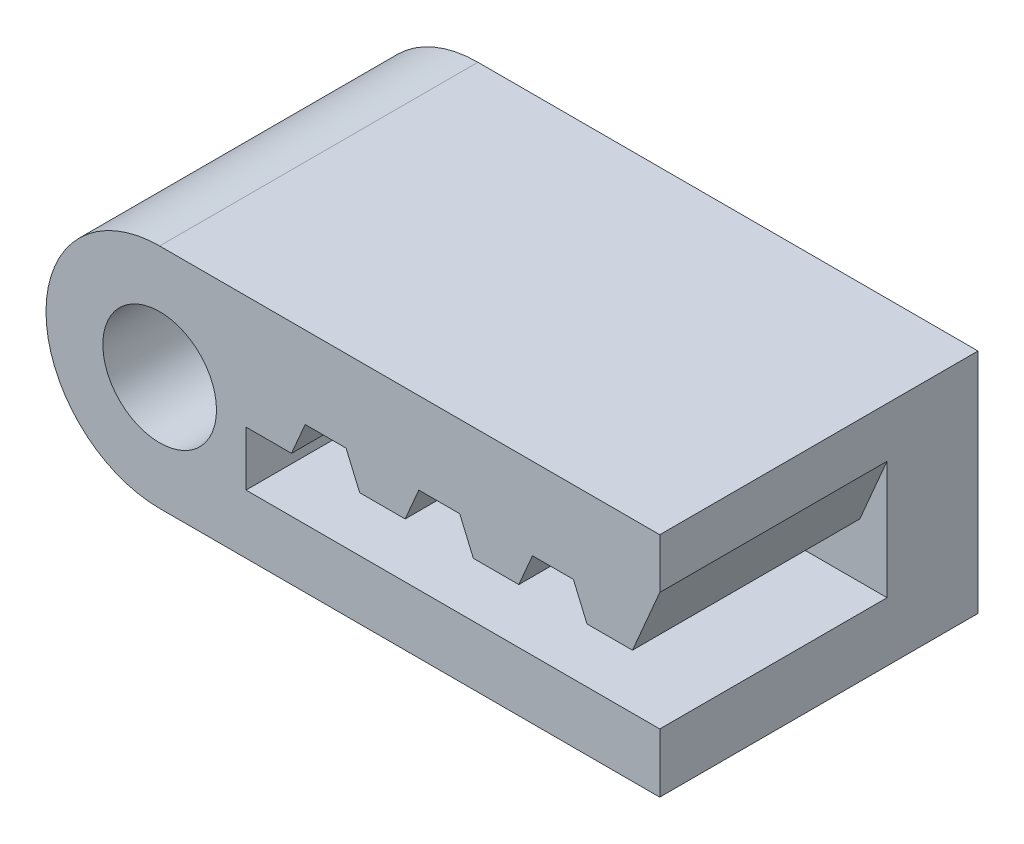
ISO-10303-21;
HEADER;
FILE_DESCRIPTION(('STEP AP214'),'2;1');
FILE_NAME('part.step','',(''),(''),'','','');
FILE_SCHEMA(('AUTOMOTIVE_DESIGN { 1 0 10303 214 1 1 1 1 }'));
ENDSEC;
DATA;
#1=APPLICATION_CONTEXT('core data for automotive mechanical design processes');
#2=APPLICATION_PROTOCOL_DEFINITION('international standard','automotive_design',2000,#1);
#3=PRODUCT_CONTEXT('',#1,'mechanical');
#4=PRODUCT('Part','Part','',(#3));
#5=PRODUCT_RELATED_PRODUCT_CATEGORY('part','',(#4));
#6=PRODUCT_DEFINITION_FORMATION('','',#4);
#7=PRODUCT_DEFINITION_CONTEXT('part definition',#1,'design');
#8=PRODUCT_DEFINITION('design','',#6,#7);
#9=PRODUCT_DEFINITION_SHAPE('','',#8);
#10=(LENGTH_UNIT() NAMED_UNIT(*) SI_UNIT(.MILLI.,.METRE.));
#11=(NAMED_UNIT(*) PLANE_ANGLE_UNIT() SI_UNIT($,.RADIAN.));
#12=(NAMED_UNIT(*) SI_UNIT($,.STERADIAN.) SOLID_ANGLE_UNIT());
#13=UNCERTAINTY_MEASURE_WITH_UNIT(LENGTH_MEASURE(1.E-05),#10,'distance_accuracy_value','');
#14=(GEOMETRIC_REPRESENTATION_CONTEXT(3) GLOBAL_UNCERTAINTY_ASSIGNED_CONTEXT((#13)) GLOBAL_UNIT_ASSIGNED_CONTEXT((#10,
#11,#12)) REPRESENTATION_CONTEXT('',''));
#15=CARTESIAN_POINT('',(0.,0.,0.));
#16=DIRECTION('',(0.,0.,1.));
#17=DIRECTION('',(1.,0.,0.));
#18=AXIS2_PLACEMENT_3D('',#15,#16,#17);
#19=CARTESIAN_POINT('',(0.,2.5,7.));
#20=DIRECTION('',(0.,0.,-1.));
#21=DIRECTION('',(-1.,0.,0.));
#22=AXIS2_PLACEMENT_3D('',#19,#20,#21);
#23=CYLINDRICAL_SURFACE('',#22,2.5);
#24=CARTESIAN_POINT('',(0.,2.5,0.));
#25=DIRECTION('',(0.,0.,1.));
#26=DIRECTION('',(1.,0.,0.));
#27=AXIS2_PLACEMENT_3D('',#24,#25,#26);
#28=CIRCLE('',#27,2.5);
#29=CARTESIAN_POINT('',(0.,5.,0.));
#30=VERTEX_POINT('',#29);
#31=CARTESIAN_POINT('',(0.,0.,0.));
#32=VERTEX_POINT('',#31);
#33=EDGE_CURVE('E280',#30,#32,#28,.T.);
#34=ORIENTED_EDGE('',*,*,#33,.T.);
#35=DIRECTION('',(0.,0.,-1.));
#36=VECTOR('',#35,1.);
#37=CARTESIAN_POINT('',(0.,0.,7.));
#38=LINE('',#37,#36);
#39=CARTESIAN_POINT('',(0.,0.,7.));
#40=VERTEX_POINT('',#39);
#41=EDGE_CURVE('E12',#40,#32,#38,.T.);
#42=ORIENTED_EDGE('',*,*,#41,.F.);
#43=CARTESIAN_POINT('',(0.,2.5,7.));
#44=DIRECTION('',(0.,0.,1.));
#45=DIRECTION('',(1.,0.,0.));
#46=AXIS2_PLACEMENT_3D('',#43,#44,#45);
#47=CIRCLE('',#46,2.5);
#48=CARTESIAN_POINT('',(0.,5.,7.));
#49=VERTEX_POINT('',#48);
#50=EDGE_CURVE('E282',#49,#40,#47,.T.);
#51=ORIENTED_EDGE('',*,*,#50,.F.);
#52=DIRECTION('',(0.,0.,-1.));
#53=VECTOR('',#52,1.);
#54=CARTESIAN_POINT('',(0.,5.,7.));
#55=LINE('',#54,#53);
#56=EDGE_CURVE('E290',#49,#30,#55,.T.);
#57=ORIENTED_EDGE('',*,*,#56,.T.);
#58=EDGE_LOOP('',(#34,#42,#51,#57));
#59=FACE_BOUND('',#58,.T.);
#60=ADVANCED_FACE('F32',(#59),#23,.T.);
#61=CARTESIAN_POINT('',(0.,0.,7.));
#62=DIRECTION('',(0.,1.,0.));
#63=DIRECTION('',(0.,0.,1.));
#64=AXIS2_PLACEMENT_3D('',#61,#62,#63);
#65=PLANE('',#64);
#66=DIRECTION('',(1.,0.,0.));
#67=VECTOR('',#66,1.);
#68=CARTESIAN_POINT('',(0.,0.,0.));
#69=LINE('',#68,#67);
#70=CARTESIAN_POINT('',(11.,0.,0.));
#71=VERTEX_POINT('',#70);
#72=EDGE_CURVE('E293',#32,#71,#69,.T.);
#73=ORIENTED_EDGE('',*,*,#72,.T.);
#74=DIRECTION('',(0.,0.,-1.));
#75=VECTOR('',#74,1.);
#76=CARTESIAN_POINT('',(11.,0.,7.));
#77=LINE('',#76,#75);
#78=CARTESIAN_POINT('',(11.,0.,7.));
#79=VERTEX_POINT('',#78);
#80=EDGE_CURVE('E39',#79,#71,#77,.T.);
#81=ORIENTED_EDGE('',*,*,#80,.F.);
#82=DIRECTION('',(1.,0.,0.));
#83=VECTOR('',#82,1.);
#84=CARTESIAN_POINT('',(0.,0.,7.));
#85=LINE('',#84,#83);
#86=EDGE_CURVE('E83',#40,#79,#85,.T.);
#87=ORIENTED_EDGE('',*,*,#86,.F.);
#88=ORIENTED_EDGE('',*,*,#41,.T.);
#89=EDGE_LOOP('',(#73,#81,#87,#88));
#90=FACE_BOUND('',#89,.T.);
#91=ADVANCED_FACE('F372',(#90),#65,.F.);
#92=CARTESIAN_POINT('',(11.,0.,7.));
#93=DIRECTION('',(-1.,0.,0.));
#94=DIRECTION('',(0.,0.,1.));
#95=AXIS2_PLACEMENT_3D('',#92,#93,#94);
#96=PLANE('',#95);
#97=DIRECTION('',(0.,-1.,0.));
#98=VECTOR('',#97,1.);
#99=CARTESIAN_POINT('',(11.,1.3,2.));
#100=LINE('',#99,#98);
#101=CARTESIAN_POINT('',(11.,3.9,2.));
#102=VERTEX_POINT('',#101);
#103=CARTESIAN_POINT('',(11.,1.3,2.));
#104=VERTEX_POINT('',#103);
#105=EDGE_CURVE('E281',#102,#104,#100,.T.);
#106=ORIENTED_EDGE('',*,*,#105,.T.);
#107=DIRECTION('',(0.,0.,1.));
#108=VECTOR('',#107,1.);
#109=CARTESIAN_POINT('',(11.,1.3,-9.46414285606468));
#110=LINE('',#109,#108);
#111=CARTESIAN_POINT('',(11.,1.3,7.));
#112=VERTEX_POINT('',#111);
#113=EDGE_CURVE('E247',#104,#112,#110,.T.);
#114=ORIENTED_EDGE('',*,*,#113,.T.);
#115=DIRECTION('',(0.,1.,0.));
#116=VECTOR('',#115,1.);
#117=CARTESIAN_POINT('',(11.,0.,7.));
#118=LINE('',#117,#116);
#119=EDGE_CURVE('E286',#79,#112,#118,.T.);
#120=ORIENTED_EDGE('',*,*,#119,.F.);
#121=ORIENTED_EDGE('',*,*,#80,.T.);
#122=DIRECTION('',(0.,1.,0.));
#123=VECTOR('',#122,1.);
#124=CARTESIAN_POINT('',(11.,0.,0.));
#125=LINE('',#124,#123);
#126=CARTESIAN_POINT('',(11.,5.,0.));
#127=VERTEX_POINT('',#126);
#128=EDGE_CURVE('E295',#71,#127,#125,.T.);
#129=ORIENTED_EDGE('',*,*,#128,.T.);
#130=DIRECTION('',(0.,0.,-1.));
#131=VECTOR('',#130,1.);
#132=CARTESIAN_POINT('',(11.,5.,7.));
#133=LINE('',#132,#131);
#134=CARTESIAN_POINT('',(11.,5.,7.));
#135=VERTEX_POINT('',#134);
#136=EDGE_CURVE('E299',#135,#127,#133,.T.);
#137=ORIENTED_EDGE('',*,*,#136,.F.);
#138=CARTESIAN_POINT('',(11.,3.90000000000001,7.));
#139=VERTEX_POINT('',#138);
#140=EDGE_CURVE('E285',#139,#135,#118,.T.);
#141=ORIENTED_EDGE('',*,*,#140,.F.);
#142=DIRECTION('',(0.,0.,1.));
#143=VECTOR('',#142,1.);
#144=CARTESIAN_POINT('',(11.,3.9,-9.46414285606468));
#145=LINE('',#144,#143);
#146=EDGE_CURVE('E46',#102,#139,#145,.T.);
#147=ORIENTED_EDGE('',*,*,#146,.F.);
#148=EDGE_LOOP('',(#106,#114,#120,#121,#129,#137,#141,#147));
#149=FACE_BOUND('',#148,.T.);
#150=ADVANCED_FACE('F305',(#149),#96,.F.);
#151=CARTESIAN_POINT('',(0.,5.,7.));
#152=DIRECTION('',(0.,-1.,0.));
#153=DIRECTION('',(0.,0.,-1.));
#154=AXIS2_PLACEMENT_3D('',#151,#152,#153);
#155=PLANE('',#154);
#156=DIRECTION('',(-1.,0.,0.));
#157=VECTOR('',#156,1.);
#158=CARTESIAN_POINT('',(0.,5.,0.));
#159=LINE('',#158,#157);
#160=EDGE_CURVE('E76',#127,#30,#159,.T.);
#161=ORIENTED_EDGE('',*,*,#160,.T.);
#162=ORIENTED_EDGE('',*,*,#56,.F.);
#163=DIRECTION('',(-1.,0.,0.));
#164=VECTOR('',#163,1.);
#165=CARTESIAN_POINT('',(0.,5.,7.));
#166=LINE('',#165,#164);
#167=EDGE_CURVE('E55',#135,#49,#166,.T.);
#168=ORIENTED_EDGE('',*,*,#167,.F.);
#169=ORIENTED_EDGE('',*,*,#136,.T.);
#170=EDGE_LOOP('',(#161,#162,#168,#169));
#171=FACE_BOUND('',#170,.T.);
#172=ADVANCED_FACE('F313',(#171),#155,.F.);
#173=CARTESIAN_POINT('',(0.,2.5,7.));
#174=DIRECTION('',(0.,0.,1.));
#175=DIRECTION('',(1.,0.,0.));
#176=AXIS2_PLACEMENT_3D('',#173,#174,#175);
#177=PLANE('',#176);
#178=CARTESIAN_POINT('',(0.,2.5,7.));
#179=DIRECTION('',(0.,0.,1.));
#180=DIRECTION('',(1.,0.,0.));
#181=AXIS2_PLACEMENT_3D('',#178,#179,#180);
#182=CIRCLE('',#181,1.25);
#183=CARTESIAN_POINT('',(1.25,2.5,7.));
#184=VERTEX_POINT('',#183);
#185=EDGE_CURVE('E347',#184,#184,#182,.T.);
#186=ORIENTED_EDGE('',*,*,#185,.F.);
#187=EDGE_LOOP('',(#186));
#188=FACE_BOUND('',#187,.T.);
#189=DIRECTION('',(1.,0.,0.));
#190=VECTOR('',#189,1.);
#191=CARTESIAN_POINT('',(1.89999999999999,1.3,7.));
#192=LINE('',#191,#190);
#193=CARTESIAN_POINT('',(1.89999999999999,1.3,7.));
#194=VERTEX_POINT('',#193);
#195=EDGE_CURVE('E245',#194,#112,#192,.T.);
#196=ORIENTED_EDGE('',*,*,#195,.F.);
#197=DIRECTION('',(0.,-1.,0.));
#198=VECTOR('',#197,1.);
#199=CARTESIAN_POINT('',(1.89999999999999,2.5,7.));
#200=LINE('',#199,#198);
#201=CARTESIAN_POINT('',(1.89999999999999,2.5,7.));
#202=VERTEX_POINT('',#201);
#203=EDGE_CURVE('E242',#202,#194,#200,.T.);
#204=ORIENTED_EDGE('',*,*,#203,.F.);
#205=DIRECTION('',(-1.,0.,0.));
#206=VECTOR('',#205,1.);
#207=CARTESIAN_POINT('',(2.89999999999999,2.5,7.));
#208=LINE('',#207,#206);
#209=CARTESIAN_POINT('',(2.89999999999999,2.5,7.));
#210=VERTEX_POINT('',#209);
#211=EDGE_CURVE('E239',#210,#202,#208,.T.);
#212=ORIENTED_EDGE('',*,*,#211,.F.);
#213=DIRECTION('',(-0.39391929857917,-0.919145030018057,0.));
#214=VECTOR('',#213,1.);
#215=CARTESIAN_POINT('',(3.2,3.2,7.));
#216=LINE('',#215,#214);
#217=CARTESIAN_POINT('',(3.2,3.2,7.));
#218=VERTEX_POINT('',#217);
#219=EDGE_CURVE('E236',#218,#210,#216,.T.);
#220=ORIENTED_EDGE('',*,*,#219,.F.);
#221=DIRECTION('',(-1.,0.,0.));
#222=VECTOR('',#221,1.);
#223=CARTESIAN_POINT('',(4.1,3.2,7.));
#224=LINE('',#223,#222);
#225=CARTESIAN_POINT('',(4.1,3.2,7.));
#226=VERTEX_POINT('',#225);
#227=EDGE_CURVE('E233',#226,#218,#224,.T.);
#228=ORIENTED_EDGE('',*,*,#227,.F.);
#229=DIRECTION('',(-0.393919298579169,0.919145030018057,0.));
#230=VECTOR('',#229,1.);
#231=CARTESIAN_POINT('',(4.4,2.5,7.));
#232=LINE('',#231,#230);
#233=CARTESIAN_POINT('',(4.4,2.5,7.));
#234=VERTEX_POINT('',#233);
#235=EDGE_CURVE('E230',#234,#226,#232,.T.);
#236=ORIENTED_EDGE('',*,*,#235,.F.);
#237=DIRECTION('',(-1.,0.,0.));
#238=VECTOR('',#237,1.);
#239=CARTESIAN_POINT('',(5.4,2.5,7.));
#240=LINE('',#239,#238);
#241=CARTESIAN_POINT('',(5.4,2.5,7.));
#242=VERTEX_POINT('',#241);
#243=EDGE_CURVE('E227',#242,#234,#240,.T.);
#244=ORIENTED_EDGE('',*,*,#243,.F.);
#245=DIRECTION('',(-0.39391929857917,-0.919145030018057,0.));
#246=VECTOR('',#245,1.);
#247=CARTESIAN_POINT('',(5.7,3.2,7.));
#248=LINE('',#247,#246);
#249=CARTESIAN_POINT('',(5.7,3.2,7.));
#250=VERTEX_POINT('',#249);
#251=EDGE_CURVE('E224',#250,#242,#248,.T.);
#252=ORIENTED_EDGE('',*,*,#251,.F.);
#253=DIRECTION('',(-1.,0.,0.));
#254=VECTOR('',#253,1.);
#255=CARTESIAN_POINT('',(6.6,3.2,7.));
#256=LINE('',#255,#254);
#257=CARTESIAN_POINT('',(6.6,3.2,7.));
#258=VERTEX_POINT('',#257);
#259=EDGE_CURVE('E221',#258,#250,#256,.T.);
#260=ORIENTED_EDGE('',*,*,#259,.F.);
#261=DIRECTION('',(-0.393919298579168,0.919145030018058,0.));
#262=VECTOR('',#261,1.);
#263=CARTESIAN_POINT('',(6.9,2.5,7.));
#264=LINE('',#263,#262);
#265=CARTESIAN_POINT('',(6.9,2.5,7.));
#266=VERTEX_POINT('',#265);
#267=EDGE_CURVE('E218',#266,#258,#264,.T.);
#268=ORIENTED_EDGE('',*,*,#267,.F.);
#269=DIRECTION('',(-1.,0.,0.));
#270=VECTOR('',#269,1.);
#271=CARTESIAN_POINT('',(7.9,2.5,7.));
#272=LINE('',#271,#270);
#273=CARTESIAN_POINT('',(7.9,2.5,7.));
#274=VERTEX_POINT('',#273);
#275=EDGE_CURVE('E215',#274,#266,#272,.T.);
#276=ORIENTED_EDGE('',*,*,#275,.F.);
#277=DIRECTION('',(-0.393919298579166,-0.919145030018059,0.));
#278=VECTOR('',#277,1.);
#279=CARTESIAN_POINT('',(8.2,3.2,7.));
#280=LINE('',#279,#278);
#281=CARTESIAN_POINT('',(8.2,3.2,7.));
#282=VERTEX_POINT('',#281);
#283=EDGE_CURVE('E212',#282,#274,#280,.T.);
#284=ORIENTED_EDGE('',*,*,#283,.F.);
#285=DIRECTION('',(-1.,0.,0.));
#286=VECTOR('',#285,1.);
#287=CARTESIAN_POINT('',(9.1,3.2,7.));
#288=LINE('',#287,#286);
#289=CARTESIAN_POINT('',(9.1,3.2,7.));
#290=VERTEX_POINT('',#289);
#291=EDGE_CURVE('E206',#290,#282,#288,.T.);
#292=ORIENTED_EDGE('',*,*,#291,.F.);
#293=DIRECTION('',(-0.393919298579167,0.919145030018058,0.));
#294=VECTOR('',#293,1.);
#295=CARTESIAN_POINT('',(9.4,2.5,7.));
#296=LINE('',#295,#294);
#297=CARTESIAN_POINT('',(9.4,2.5,7.));
#298=VERTEX_POINT('',#297);
#299=EDGE_CURVE('E204',#298,#290,#296,.T.);
#300=ORIENTED_EDGE('',*,*,#299,.F.);
#301=DIRECTION('',(-1.,0.,0.));
#302=VECTOR('',#301,1.);
#303=CARTESIAN_POINT('',(10.4,2.5,7.));
#304=LINE('',#303,#302);
#305=CARTESIAN_POINT('',(10.4,2.5,7.));
#306=VERTEX_POINT('',#305);
#307=EDGE_CURVE('E188',#306,#298,#304,.T.);
#308=ORIENTED_EDGE('',*,*,#307,.F.);
#309=DIRECTION('',(-0.393919298579167,-0.919145030018058,0.));
#310=VECTOR('',#309,1.);
#311=CARTESIAN_POINT('',(11.,3.9,7.));
#312=LINE('',#311,#310);
#313=EDGE_CURVE('E195',#139,#306,#312,.T.);
#314=ORIENTED_EDGE('',*,*,#313,.F.);
#315=ORIENTED_EDGE('',*,*,#140,.T.);
#316=ORIENTED_EDGE('',*,*,#167,.T.);
#317=ORIENTED_EDGE('',*,*,#50,.T.);
#318=ORIENTED_EDGE('',*,*,#86,.T.);
#319=ORIENTED_EDGE('',*,*,#119,.T.);
#320=EDGE_LOOP('',(#196,#204,#212,#220,#228,#236,#244,#252,#260,#268,#276,#284,#292,#300,#308,
#314,#315,#316,#317,#318,#319));
#321=FACE_BOUND('',#320,.T.);
#322=ADVANCED_FACE('F201',(#188,#321),#177,.T.);
#323=CARTESIAN_POINT('',(0.,2.5,0.));
#324=DIRECTION('',(0.,0.,1.));
#325=DIRECTION('',(1.,0.,0.));
#326=AXIS2_PLACEMENT_3D('',#323,#324,#325);
#327=PLANE('',#326);
#328=CARTESIAN_POINT('',(0.,2.5,0.));
#329=DIRECTION('',(0.,0.,1.));
#330=DIRECTION('',(1.,0.,0.));
#331=AXIS2_PLACEMENT_3D('',#328,#329,#330);
#332=CIRCLE('',#331,1.25);
#333=CARTESIAN_POINT('',(1.25,2.5,0.));
#334=VERTEX_POINT('',#333);
#335=EDGE_CURVE('E198',#334,#334,#332,.T.);
#336=ORIENTED_EDGE('',*,*,#335,.T.);
#337=EDGE_LOOP('',(#336));
#338=FACE_BOUND('',#337,.T.);
#339=ORIENTED_EDGE('',*,*,#33,.F.);
#340=ORIENTED_EDGE('',*,*,#160,.F.);
#341=ORIENTED_EDGE('',*,*,#128,.F.);
#342=ORIENTED_EDGE('',*,*,#72,.F.);
#343=EDGE_LOOP('',(#339,#340,#341,#342));
#344=FACE_BOUND('',#343,.T.);
#345=ADVANCED_FACE('F309',(#338,#344),#327,.F.);
#346=CARTESIAN_POINT('',(1.89999999999999,1.3,-9.46414285606468));
#347=DIRECTION('',(0.,-1.,0.));
#348=DIRECTION('',(0.,0.,-1.));
#349=AXIS2_PLACEMENT_3D('',#346,#347,#348);
#350=PLANE('',#349);
#351=DIRECTION('',(-1.,0.,0.));
#352=VECTOR('',#351,1.);
#353=CARTESIAN_POINT('',(1.89999999999999,1.3,2.));
#354=LINE('',#353,#352);
#355=CARTESIAN_POINT('',(1.89999999999999,1.3,2.));
#356=VERTEX_POINT('',#355);
#357=EDGE_CURVE('E317',#104,#356,#354,.T.);
#358=ORIENTED_EDGE('',*,*,#357,.T.);
#359=DIRECTION('',(0.,0.,1.));
#360=VECTOR('',#359,1.);
#361=CARTESIAN_POINT('',(1.89999999999999,1.3,-9.46414285606468));
#362=LINE('',#361,#360);
#363=EDGE_CURVE('E250',#356,#194,#362,.T.);
#364=ORIENTED_EDGE('',*,*,#363,.T.);
#365=ORIENTED_EDGE('',*,*,#195,.T.);
#366=ORIENTED_EDGE('',*,*,#113,.F.);
#367=EDGE_LOOP('',(#358,#364,#365,#366));
#368=FACE_BOUND('',#367,.T.);
#369=ADVANCED_FACE('F367',(#368),#350,.F.);
#370=CARTESIAN_POINT('',(1.89999999999999,2.5,-9.46414285606468));
#371=DIRECTION('',(-1.,0.,0.));
#372=DIRECTION('',(0.,0.,1.));
#373=AXIS2_PLACEMENT_3D('',#370,#371,#372);
#374=PLANE('',#373);
#375=DIRECTION('',(0.,1.,0.));
#376=VECTOR('',#375,1.);
#377=CARTESIAN_POINT('',(1.89999999999999,2.5,2.));
#378=LINE('',#377,#376);
#379=CARTESIAN_POINT('',(1.89999999999999,2.5,2.));
#380=VERTEX_POINT('',#379);
#381=EDGE_CURVE('E318',#356,#380,#378,.T.);
#382=ORIENTED_EDGE('',*,*,#381,.T.);
#383=DIRECTION('',(0.,0.,1.));
#384=VECTOR('',#383,1.);
#385=CARTESIAN_POINT('',(1.89999999999999,2.5,-9.46414285606468));
#386=LINE('',#385,#384);
#387=EDGE_CURVE('E252',#380,#202,#386,.T.);
#388=ORIENTED_EDGE('',*,*,#387,.T.);
#389=ORIENTED_EDGE('',*,*,#203,.T.);
#390=ORIENTED_EDGE('',*,*,#363,.F.);
#391=EDGE_LOOP('',(#382,#388,#389,#390));
#392=FACE_BOUND('',#391,.T.);
#393=ADVANCED_FACE('F417',(#392),#374,.F.);
#394=CARTESIAN_POINT('',(2.89999999999999,2.5,-9.46414285606468));
#395=DIRECTION('',(0.,1.,0.));
#396=DIRECTION('',(-1.,0.,0.));
#397=AXIS2_PLACEMENT_3D('',#394,#395,#396);
#398=PLANE('',#397);
#399=DIRECTION('',(1.,0.,0.));
#400=VECTOR('',#399,1.);
#401=CARTESIAN_POINT('',(2.89999999999999,2.5,2.));
#402=LINE('',#401,#400);
#403=CARTESIAN_POINT('',(2.89999999999999,2.5,2.));
#404=VERTEX_POINT('',#403);
#405=EDGE_CURVE('E322',#380,#404,#402,.T.);
#406=ORIENTED_EDGE('',*,*,#405,.T.);
#407=DIRECTION('',(0.,0.,1.));
#408=VECTOR('',#407,1.);
#409=CARTESIAN_POINT('',(2.89999999999999,2.5,-9.46414285606468));
#410=LINE('',#409,#408);
#411=EDGE_CURVE('E254',#404,#210,#410,.T.);
#412=ORIENTED_EDGE('',*,*,#411,.T.);
#413=ORIENTED_EDGE('',*,*,#211,.T.);
#414=ORIENTED_EDGE('',*,*,#387,.F.);
#415=EDGE_LOOP('',(#406,#412,#413,#414));
#416=FACE_BOUND('',#415,.T.);
#417=ADVANCED_FACE('F426',(#416),#398,.F.);
#418=CARTESIAN_POINT('',(3.2,3.2,-9.46414285606468));
#419=DIRECTION('',(-0.919145030018057,0.39391929857917,0.));
#420=DIRECTION('',(-0.39391929857917,-0.919145030018057,0.));
#421=AXIS2_PLACEMENT_3D('',#418,#419,#420);
#422=PLANE('',#421);
#423=DIRECTION('',(0.39391929857917,0.919145030018057,0.));
#424=VECTOR('',#423,1.);
#425=CARTESIAN_POINT('',(3.2,3.2,2.));
#426=LINE('',#425,#424);
#427=CARTESIAN_POINT('',(3.2,3.2,2.));
#428=VERTEX_POINT('',#427);
#429=EDGE_CURVE('E324',#404,#428,#426,.T.);
#430=ORIENTED_EDGE('',*,*,#429,.T.);
#431=DIRECTION('',(0.,0.,1.));
#432=VECTOR('',#431,1.);
#433=CARTESIAN_POINT('',(3.2,3.2,-9.46414285606468));
#434=LINE('',#433,#432);
#435=EDGE_CURVE('E256',#428,#218,#434,.T.);
#436=ORIENTED_EDGE('',*,*,#435,.T.);
#437=ORIENTED_EDGE('',*,*,#219,.T.);
#438=ORIENTED_EDGE('',*,*,#411,.F.);
#439=EDGE_LOOP('',(#430,#436,#437,#438));
#440=FACE_BOUND('',#439,.T.);
#441=ADVANCED_FACE('F435',(#440),#422,.F.);
#442=CARTESIAN_POINT('',(4.1,3.2,-9.46414285606468));
#443=DIRECTION('',(0.,1.,0.));
#444=DIRECTION('',(0.,0.,1.));
#445=AXIS2_PLACEMENT_3D('',#442,#443,#444);
#446=PLANE('',#445);
#447=DIRECTION('',(1.,0.,0.));
#448=VECTOR('',#447,1.);
#449=CARTESIAN_POINT('',(4.1,3.2,2.));
#450=LINE('',#449,#448);
#451=CARTESIAN_POINT('',(4.1,3.2,2.));
#452=VERTEX_POINT('',#451);
#453=EDGE_CURVE('E326',#428,#452,#450,.T.);
#454=ORIENTED_EDGE('',*,*,#453,.T.);
#455=DIRECTION('',(0.,0.,1.));
#456=VECTOR('',#455,1.);
#457=CARTESIAN_POINT('',(4.1,3.2,-9.46414285606468));
#458=LINE('',#457,#456);
#459=EDGE_CURVE('E258',#452,#226,#458,.T.);
#460=ORIENTED_EDGE('',*,*,#459,.T.);
#461=ORIENTED_EDGE('',*,*,#227,.T.);
#462=ORIENTED_EDGE('',*,*,#435,.F.);
#463=EDGE_LOOP('',(#454,#460,#461,#462));
#464=FACE_BOUND('',#463,.T.);
#465=ADVANCED_FACE('F444',(#464),#446,.F.);
#466=CARTESIAN_POINT('',(4.4,2.5,-9.46414285606468));
#467=DIRECTION('',(0.919145030018057,0.393919298579169,0.));
#468=DIRECTION('',(-0.393919298579169,0.919145030018057,0.));
#469=AXIS2_PLACEMENT_3D('',#466,#467,#468);
#470=PLANE('',#469);
#471=DIRECTION('',(0.393919298579169,-0.919145030018057,0.));
#472=VECTOR('',#471,1.);
#473=CARTESIAN_POINT('',(4.4,2.5,2.));
#474=LINE('',#473,#472);
#475=CARTESIAN_POINT('',(4.4,2.5,2.));
#476=VERTEX_POINT('',#475);
#477=EDGE_CURVE('E328',#452,#476,#474,.T.);
#478=ORIENTED_EDGE('',*,*,#477,.T.);
#479=DIRECTION('',(0.,0.,1.));
#480=VECTOR('',#479,1.);
#481=CARTESIAN_POINT('',(4.4,2.5,-9.46414285606468));
#482=LINE('',#481,#480);
#483=EDGE_CURVE('E260',#476,#234,#482,.T.);
#484=ORIENTED_EDGE('',*,*,#483,.T.);
#485=ORIENTED_EDGE('',*,*,#235,.T.);
#486=ORIENTED_EDGE('',*,*,#459,.F.);
#487=EDGE_LOOP('',(#478,#484,#485,#486));
#488=FACE_BOUND('',#487,.T.);
#489=ADVANCED_FACE('F453',(#488),#470,.F.);
#490=CARTESIAN_POINT('',(5.4,2.5,-9.46414285606468));
#491=DIRECTION('',(0.,1.,0.));
#492=DIRECTION('',(0.,0.,1.));
#493=AXIS2_PLACEMENT_3D('',#490,#491,#492);
#494=PLANE('',#493);
#495=DIRECTION('',(1.,0.,0.));
#496=VECTOR('',#495,1.);
#497=CARTESIAN_POINT('',(5.4,2.5,2.));
#498=LINE('',#497,#496);
#499=CARTESIAN_POINT('',(5.4,2.5,2.));
#500=VERTEX_POINT('',#499);
#501=EDGE_CURVE('E330',#476,#500,#498,.T.);
#502=ORIENTED_EDGE('',*,*,#501,.T.);
#503=DIRECTION('',(0.,0.,1.));
#504=VECTOR('',#503,1.);
#505=CARTESIAN_POINT('',(5.4,2.5,-9.46414285606468));
#506=LINE('',#505,#504);
#507=EDGE_CURVE('E262',#500,#242,#506,.T.);
#508=ORIENTED_EDGE('',*,*,#507,.T.);
#509=ORIENTED_EDGE('',*,*,#243,.T.);
#510=ORIENTED_EDGE('',*,*,#483,.F.);
#511=EDGE_LOOP('',(#502,#508,#509,#510));
#512=FACE_BOUND('',#511,.T.);
#513=ADVANCED_FACE('F462',(#512),#494,.F.);
#514=CARTESIAN_POINT('',(5.7,3.2,-9.46414285606468));
#515=DIRECTION('',(-0.919145030018057,0.39391929857917,0.));
#516=DIRECTION('',(-0.39391929857917,-0.919145030018057,0.));
#517=AXIS2_PLACEMENT_3D('',#514,#515,#516);
#518=PLANE('',#517);
#519=DIRECTION('',(0.39391929857917,0.919145030018057,0.));
#520=VECTOR('',#519,1.);
#521=CARTESIAN_POINT('',(5.7,3.2,2.));
#522=LINE('',#521,#520);
#523=CARTESIAN_POINT('',(5.7,3.2,2.));
#524=VERTEX_POINT('',#523);
#525=EDGE_CURVE('E332',#500,#524,#522,.T.);
#526=ORIENTED_EDGE('',*,*,#525,.T.);
#527=DIRECTION('',(0.,0.,1.));
#528=VECTOR('',#527,1.);
#529=CARTESIAN_POINT('',(5.7,3.2,-9.46414285606468));
#530=LINE('',#529,#528);
#531=EDGE_CURVE('E264',#524,#250,#530,.T.);
#532=ORIENTED_EDGE('',*,*,#531,.T.);
#533=ORIENTED_EDGE('',*,*,#251,.T.);
#534=ORIENTED_EDGE('',*,*,#507,.F.);
#535=EDGE_LOOP('',(#526,#532,#533,#534));
#536=FACE_BOUND('',#535,.T.);
#537=ADVANCED_FACE('F471',(#536),#518,.F.);
#538=CARTESIAN_POINT('',(6.6,3.2,-9.46414285606468));
#539=DIRECTION('',(0.,1.,0.));
#540=DIRECTION('',(0.,0.,1.));
#541=AXIS2_PLACEMENT_3D('',#538,#539,#540);
#542=PLANE('',#541);
#543=DIRECTION('',(1.,0.,0.));
#544=VECTOR('',#543,1.);
#545=CARTESIAN_POINT('',(6.6,3.2,2.));
#546=LINE('',#545,#544);
#547=CARTESIAN_POINT('',(6.6,3.2,2.));
#548=VERTEX_POINT('',#547);
#549=EDGE_CURVE('E334',#524,#548,#546,.T.);
#550=ORIENTED_EDGE('',*,*,#549,.T.);
#551=DIRECTION('',(0.,0.,1.));
#552=VECTOR('',#551,1.);
#553=CARTESIAN_POINT('',(6.6,3.2,-9.46414285606468));
#554=LINE('',#553,#552);
#555=EDGE_CURVE('E266',#548,#258,#554,.T.);
#556=ORIENTED_EDGE('',*,*,#555,.T.);
#557=ORIENTED_EDGE('',*,*,#259,.T.);
#558=ORIENTED_EDGE('',*,*,#531,.F.);
#559=EDGE_LOOP('',(#550,#556,#557,#558));
#560=FACE_BOUND('',#559,.T.);
#561=ADVANCED_FACE('F480',(#560),#542,.F.);
#562=CARTESIAN_POINT('',(6.9,2.5,-9.46414285606468));
#563=DIRECTION('',(0.919145030018058,0.393919298579168,0.));
#564=DIRECTION('',(-0.393919298579168,0.919145030018058,0.));
#565=AXIS2_PLACEMENT_3D('',#562,#563,#564);
#566=PLANE('',#565);
#567=DIRECTION('',(0.393919298579168,-0.919145030018058,0.));
#568=VECTOR('',#567,1.);
#569=CARTESIAN_POINT('',(6.9,2.5,2.));
#570=LINE('',#569,#568);
#571=CARTESIAN_POINT('',(6.9,2.5,2.));
#572=VERTEX_POINT('',#571);
#573=EDGE_CURVE('E336',#548,#572,#570,.T.);
#574=ORIENTED_EDGE('',*,*,#573,.T.);
#575=DIRECTION('',(0.,0.,1.));
#576=VECTOR('',#575,1.);
#577=CARTESIAN_POINT('',(6.9,2.5,-9.46414285606468));
#578=LINE('',#577,#576);
#579=EDGE_CURVE('E268',#572,#266,#578,.T.);
#580=ORIENTED_EDGE('',*,*,#579,.T.);
#581=ORIENTED_EDGE('',*,*,#267,.T.);
#582=ORIENTED_EDGE('',*,*,#555,.F.);
#583=EDGE_LOOP('',(#574,#580,#581,#582));
#584=FACE_BOUND('',#583,.T.);
#585=ADVANCED_FACE('F489',(#584),#566,.F.);
#586=CARTESIAN_POINT('',(7.9,2.5,-9.46414285606468));
#587=DIRECTION('',(0.,1.,0.));
#588=DIRECTION('',(0.,0.,1.));
#589=AXIS2_PLACEMENT_3D('',#586,#587,#588);
#590=PLANE('',#589);
#591=DIRECTION('',(1.,0.,0.));
#592=VECTOR('',#591,1.);
#593=CARTESIAN_POINT('',(7.9,2.5,2.));
#594=LINE('',#593,#592);
#595=CARTESIAN_POINT('',(7.9,2.5,2.));
#596=VERTEX_POINT('',#595);
#597=EDGE_CURVE('E338',#572,#596,#594,.T.);
#598=ORIENTED_EDGE('',*,*,#597,.T.);
#599=DIRECTION('',(0.,0.,1.));
#600=VECTOR('',#599,1.);
#601=CARTESIAN_POINT('',(7.9,2.5,-9.46414285606468));
#602=LINE('',#601,#600);
#603=EDGE_CURVE('E270',#596,#274,#602,.T.);
#604=ORIENTED_EDGE('',*,*,#603,.T.);
#605=ORIENTED_EDGE('',*,*,#275,.T.);
#606=ORIENTED_EDGE('',*,*,#579,.F.);
#607=EDGE_LOOP('',(#598,#604,#605,#606));
#608=FACE_BOUND('',#607,.T.);
#609=ADVANCED_FACE('F498',(#608),#590,.F.);
#610=CARTESIAN_POINT('',(8.2,3.2,-9.46414285606468));
#611=DIRECTION('',(-0.919145030018059,0.393919298579166,0.));
#612=DIRECTION('',(-0.393919298579166,-0.919145030018059,0.));
#613=AXIS2_PLACEMENT_3D('',#610,#611,#612);
#614=PLANE('',#613);
#615=DIRECTION('',(0.393919298579166,0.919145030018059,0.));
#616=VECTOR('',#615,1.);
#617=CARTESIAN_POINT('',(8.2,3.2,2.));
#618=LINE('',#617,#616);
#619=CARTESIAN_POINT('',(8.2,3.2,2.));
#620=VERTEX_POINT('',#619);
#621=EDGE_CURVE('E340',#596,#620,#618,.T.);
#622=ORIENTED_EDGE('',*,*,#621,.T.);
#623=DIRECTION('',(0.,0.,1.));
#624=VECTOR('',#623,1.);
#625=CARTESIAN_POINT('',(8.2,3.2,-9.46414285606468));
#626=LINE('',#625,#624);
#627=EDGE_CURVE('E272',#620,#282,#626,.T.);
#628=ORIENTED_EDGE('',*,*,#627,.T.);
#629=ORIENTED_EDGE('',*,*,#283,.T.);
#630=ORIENTED_EDGE('',*,*,#603,.F.);
#631=EDGE_LOOP('',(#622,#628,#629,#630));
#632=FACE_BOUND('',#631,.T.);
#633=ADVANCED_FACE('F507',(#632),#614,.F.);
#634=CARTESIAN_POINT('',(9.1,3.2,-9.46414285606468));
#635=DIRECTION('',(0.,1.,0.));
#636=DIRECTION('',(0.,0.,1.));
#637=AXIS2_PLACEMENT_3D('',#634,#635,#636);
#638=PLANE('',#637);
#639=DIRECTION('',(1.,0.,0.));
#640=VECTOR('',#639,1.);
#641=CARTESIAN_POINT('',(9.1,3.2,2.));
#642=LINE('',#641,#640);
#643=CARTESIAN_POINT('',(9.1,3.2,2.));
#644=VERTEX_POINT('',#643);
#645=EDGE_CURVE('E342',#620,#644,#642,.T.);
#646=ORIENTED_EDGE('',*,*,#645,.T.);
#647=DIRECTION('',(0.,0.,1.));
#648=VECTOR('',#647,1.);
#649=CARTESIAN_POINT('',(9.1,3.2,-9.46414285606468));
#650=LINE('',#649,#648);
#651=EDGE_CURVE('E274',#644,#290,#650,.T.);
#652=ORIENTED_EDGE('',*,*,#651,.T.);
#653=ORIENTED_EDGE('',*,*,#291,.T.);
#654=ORIENTED_EDGE('',*,*,#627,.F.);
#655=EDGE_LOOP('',(#646,#652,#653,#654));
#656=FACE_BOUND('',#655,.T.);
#657=ADVANCED_FACE('F516',(#656),#638,.F.);
#658=CARTESIAN_POINT('',(9.4,2.5,-9.46414285606468));
#659=DIRECTION('',(0.919145030018058,0.393919298579167,0.));
#660=DIRECTION('',(-0.393919298579168,0.919145030018058,0.));
#661=AXIS2_PLACEMENT_3D('',#658,#659,#660);
#662=PLANE('',#661);
#663=DIRECTION('',(0.393919298579168,-0.919145030018058,0.));
#664=VECTOR('',#663,1.);
#665=CARTESIAN_POINT('',(9.4,2.5,2.));
#666=LINE('',#665,#664);
#667=CARTESIAN_POINT('',(9.4,2.5,2.));
#668=VERTEX_POINT('',#667);
#669=EDGE_CURVE('E344',#644,#668,#666,.T.);
#670=ORIENTED_EDGE('',*,*,#669,.T.);
#671=DIRECTION('',(0.,0.,1.));
#672=VECTOR('',#671,1.);
#673=CARTESIAN_POINT('',(9.4,2.5,-9.46414285606468));
#674=LINE('',#673,#672);
#675=EDGE_CURVE('E193',#668,#298,#674,.T.);
#676=ORIENTED_EDGE('',*,*,#675,.T.);
#677=ORIENTED_EDGE('',*,*,#299,.T.);
#678=ORIENTED_EDGE('',*,*,#651,.F.);
#679=EDGE_LOOP('',(#670,#676,#677,#678));
#680=FACE_BOUND('',#679,.T.);
#681=ADVANCED_FACE('F525',(#680),#662,.F.);
#682=CARTESIAN_POINT('',(10.4,2.5,-9.46414285606468));
#683=DIRECTION('',(0.,1.,0.));
#684=DIRECTION('',(0.,0.,1.));
#685=AXIS2_PLACEMENT_3D('',#682,#683,#684);
#686=PLANE('',#685);
#687=DIRECTION('',(1.,0.,0.));
#688=VECTOR('',#687,1.);
#689=CARTESIAN_POINT('',(10.4,2.5,2.));
#690=LINE('',#689,#688);
#691=CARTESIAN_POINT('',(10.4,2.5,2.));
#692=VERTEX_POINT('',#691);
#693=EDGE_CURVE('E191',#668,#692,#690,.T.);
#694=ORIENTED_EDGE('',*,*,#693,.T.);
#695=DIRECTION('',(0.,0.,1.));
#696=VECTOR('',#695,1.);
#697=CARTESIAN_POINT('',(10.4,2.5,-9.46414285606468));
#698=LINE('',#697,#696);
#699=EDGE_CURVE('E184',#692,#306,#698,.T.);
#700=ORIENTED_EDGE('',*,*,#699,.T.);
#701=ORIENTED_EDGE('',*,*,#307,.T.);
#702=ORIENTED_EDGE('',*,*,#675,.F.);
#703=EDGE_LOOP('',(#694,#700,#701,#702));
#704=FACE_BOUND('',#703,.T.);
#705=ADVANCED_FACE('F185',(#704),#686,.F.);
#706=CARTESIAN_POINT('',(11.,3.9,-9.46414285606468));
#707=DIRECTION('',(-0.919145030018058,0.393919298579167,0.));
#708=DIRECTION('',(-0.393919298579167,-0.919145030018058,0.));
#709=AXIS2_PLACEMENT_3D('',#706,#707,#708);
#710=PLANE('',#709);
#711=DIRECTION('',(0.393919298579167,0.919145030018058,0.));
#712=VECTOR('',#711,1.);
#713=CARTESIAN_POINT('',(11.,3.9,2.));
#714=LINE('',#713,#712);
#715=EDGE_CURVE('E278',#692,#102,#714,.T.);
#716=ORIENTED_EDGE('',*,*,#715,.T.);
#717=ORIENTED_EDGE('',*,*,#146,.T.);
#718=ORIENTED_EDGE('',*,*,#313,.T.);
#719=ORIENTED_EDGE('',*,*,#699,.F.);
#720=EDGE_LOOP('',(#716,#717,#718,#719));
#721=FACE_BOUND('',#720,.T.);
#722=ADVANCED_FACE('F196',(#721),#710,.F.);
#723=CARTESIAN_POINT('',(0.,2.5,2.));
#724=DIRECTION('',(0.,0.,1.));
#725=DIRECTION('',(1.,0.,0.));
#726=AXIS2_PLACEMENT_3D('',#723,#724,#725);
#727=PLANE('',#726);
#728=ORIENTED_EDGE('',*,*,#105,.F.);
#729=ORIENTED_EDGE('',*,*,#715,.F.);
#730=ORIENTED_EDGE('',*,*,#693,.F.);
#731=ORIENTED_EDGE('',*,*,#669,.F.);
#732=ORIENTED_EDGE('',*,*,#645,.F.);
#733=ORIENTED_EDGE('',*,*,#621,.F.);
#734=ORIENTED_EDGE('',*,*,#597,.F.);
#735=ORIENTED_EDGE('',*,*,#573,.F.);
#736=ORIENTED_EDGE('',*,*,#549,.F.);
#737=ORIENTED_EDGE('',*,*,#525,.F.);
#738=ORIENTED_EDGE('',*,*,#501,.F.);
#739=ORIENTED_EDGE('',*,*,#477,.F.);
#740=ORIENTED_EDGE('',*,*,#453,.F.);
#741=ORIENTED_EDGE('',*,*,#429,.F.);
#742=ORIENTED_EDGE('',*,*,#405,.F.);
#743=ORIENTED_EDGE('',*,*,#381,.F.);
#744=ORIENTED_EDGE('',*,*,#357,.F.);
#745=EDGE_LOOP('',(#728,#729,#730,#731,#732,#733,#734,#735,#736,#737,#738,#739,#740,#741,#742,
#743,#744));
#746=FACE_BOUND('',#745,.T.);
#747=ADVANCED_FACE('F357',(#746),#727,.T.);
#748=CARTESIAN_POINT('',(0.,2.5,0.));
#749=DIRECTION('',(0.,0.,1.));
#750=DIRECTION('',(1.,0.,0.));
#751=AXIS2_PLACEMENT_3D('',#748,#749,#750);
#752=CYLINDRICAL_SURFACE('',#751,1.25);
#753=ORIENTED_EDGE('',*,*,#335,.F.);
#754=EDGE_LOOP('',(#753));
#755=FACE_BOUND('',#754,.T.);
#756=ORIENTED_EDGE('',*,*,#185,.T.);
#757=EDGE_LOOP('',(#756));
#758=FACE_BOUND('',#757,.T.);
#759=ADVANCED_FACE('F354',(#755,#758),#752,.F.);
#760=CLOSED_SHELL('',(#60,#91,#150,#172,#322,#345,#369,#393,#417,#441,#465,#489,#513,#537,#561,
#585,#609,#633,#657,#681,#705,#722,#747,#759));
#761=MANIFOLD_SOLID_BREP('B2',#760);
#762=ADVANCED_BREP_SHAPE_REPRESENTATION('',(#18,#761),#14);
#763=SHAPE_DEFINITION_REPRESENTATION(#9,#762);
ENDSEC;
END-ISO-10303-21;
